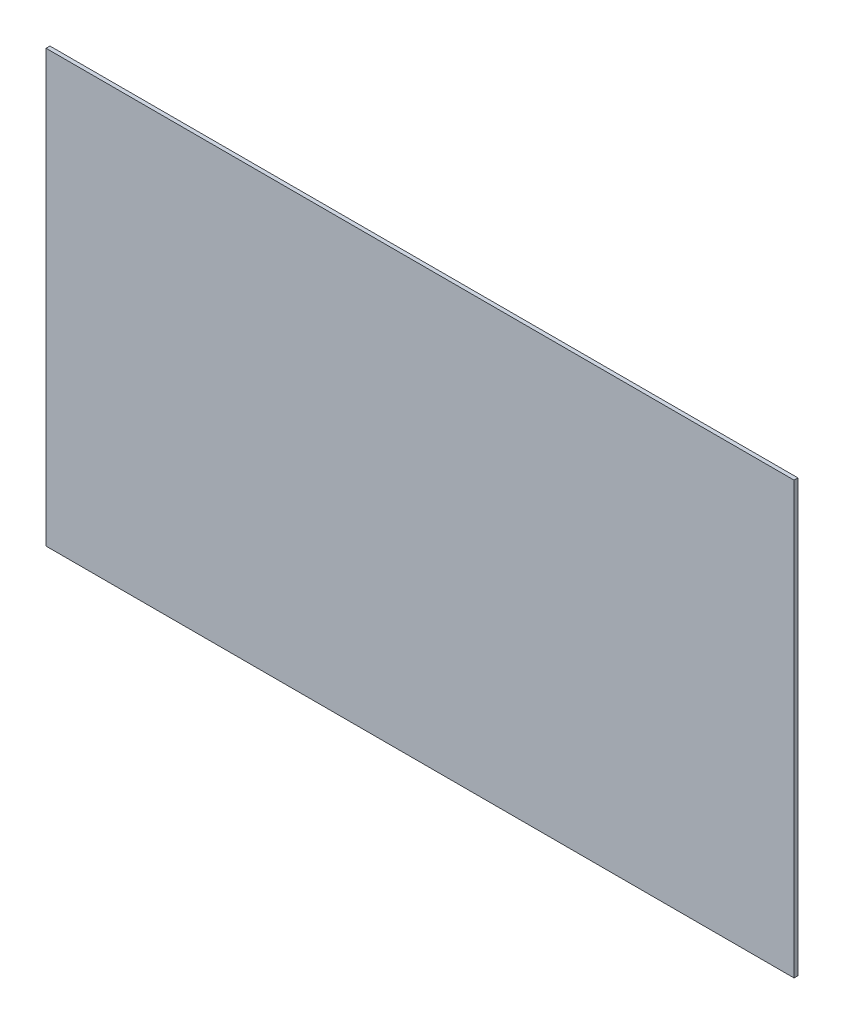
ISO-10303-21;
HEADER;
FILE_DESCRIPTION(('STEP AP214'),'2;1');
FILE_NAME('part.step','',(''),(''),'','','');
FILE_SCHEMA(('AUTOMOTIVE_DESIGN { 1 0 10303 214 1 1 1 1 }'));
ENDSEC;
DATA;
#1=APPLICATION_CONTEXT('core data for automotive mechanical design processes');
#2=APPLICATION_PROTOCOL_DEFINITION('international standard','automotive_design',2000,#1);
#3=PRODUCT_CONTEXT('',#1,'mechanical');
#4=PRODUCT('Part','Part','',(#3));
#5=PRODUCT_RELATED_PRODUCT_CATEGORY('part','',(#4));
#6=PRODUCT_DEFINITION_FORMATION('','',#4);
#7=PRODUCT_DEFINITION_CONTEXT('part definition',#1,'design');
#8=PRODUCT_DEFINITION('design','',#6,#7);
#9=PRODUCT_DEFINITION_SHAPE('','',#8);
#10=(LENGTH_UNIT() NAMED_UNIT(*) SI_UNIT(.MILLI.,.METRE.));
#11=(NAMED_UNIT(*) PLANE_ANGLE_UNIT() SI_UNIT($,.RADIAN.));
#12=(NAMED_UNIT(*) SI_UNIT($,.STERADIAN.) SOLID_ANGLE_UNIT());
#13=UNCERTAINTY_MEASURE_WITH_UNIT(LENGTH_MEASURE(1.E-05),#10,'distance_accuracy_value','');
#14=(GEOMETRIC_REPRESENTATION_CONTEXT(3) GLOBAL_UNCERTAINTY_ASSIGNED_CONTEXT((#13)) GLOBAL_UNIT_ASSIGNED_CONTEXT((#10,
#11,#12)) REPRESENTATION_CONTEXT('',''));
#15=CARTESIAN_POINT('',(0.,0.,0.));
#16=DIRECTION('',(0.,0.,1.));
#17=DIRECTION('',(1.,0.,0.));
#18=AXIS2_PLACEMENT_3D('',#15,#16,#17);
#19=CARTESIAN_POINT('',(0.,0.,9.525));
#20=DIRECTION('',(0.,0.,1.));
#21=DIRECTION('',(1.,0.,0.));
#22=AXIS2_PLACEMENT_3D('',#19,#20,#21);
#23=PLANE('',#22);
#24=DIRECTION('',(0.,1.,0.));
#25=VECTOR('',#24,1.);
#26=CARTESIAN_POINT('',(0.,1054.1,9.525));
#27=LINE('',#26,#25);
#28=CARTESIAN_POINT('',(0.,0.,9.525));
#29=VERTEX_POINT('',#28);
#30=CARTESIAN_POINT('',(0.,1054.1,9.525));
#31=VERTEX_POINT('',#30);
#32=EDGE_CURVE('E67',#29,#31,#27,.T.);
#33=ORIENTED_EDGE('',*,*,#32,.F.);
#34=DIRECTION('',(1.,0.,0.));
#35=VECTOR('',#34,1.);
#36=CARTESIAN_POINT('',(0.,0.,9.525));
#37=LINE('',#36,#35);
#38=CARTESIAN_POINT('',(1828.8,0.,9.525));
#39=VERTEX_POINT('',#38);
#40=EDGE_CURVE('E19',#39,#29,#37,.F.);
#41=ORIENTED_EDGE('',*,*,#40,.F.);
#42=DIRECTION('',(0.,1.,0.));
#43=VECTOR('',#42,1.);
#44=CARTESIAN_POINT('',(1828.8,0.,9.525));
#45=LINE('',#44,#43);
#46=CARTESIAN_POINT('',(1828.8,1054.1,9.525));
#47=VERTEX_POINT('',#46);
#48=EDGE_CURVE('E57',#47,#39,#45,.F.);
#49=ORIENTED_EDGE('',*,*,#48,.F.);
#50=DIRECTION('',(1.,0.,0.));
#51=VECTOR('',#50,1.);
#52=CARTESIAN_POINT('',(1828.8,1054.1,9.525));
#53=LINE('',#52,#51);
#54=EDGE_CURVE('E52',#31,#47,#53,.T.);
#55=ORIENTED_EDGE('',*,*,#54,.F.);
#56=EDGE_LOOP('',(#33,#41,#49,#55));
#57=FACE_BOUND('',#56,.T.);
#58=ADVANCED_FACE('F16',(#57),#23,.T.);
#59=CARTESIAN_POINT('',(0.,0.,0.));
#60=DIRECTION('',(0.,-1.,0.));
#61=DIRECTION('',(0.,0.,-1.));
#62=AXIS2_PLACEMENT_3D('',#59,#60,#61);
#63=PLANE('',#62);
#64=DIRECTION('',(0.,0.,1.));
#65=VECTOR('',#64,1.);
#66=CARTESIAN_POINT('',(0.,0.,0.));
#67=LINE('',#66,#65);
#68=CARTESIAN_POINT('',(0.,0.,0.));
#69=VERTEX_POINT('',#68);
#70=EDGE_CURVE('E78',#69,#29,#67,.T.);
#71=ORIENTED_EDGE('',*,*,#70,.F.);
#72=DIRECTION('',(1.,0.,0.));
#73=VECTOR('',#72,1.);
#74=CARTESIAN_POINT('',(0.,0.,0.));
#75=LINE('',#74,#73);
#76=CARTESIAN_POINT('',(1828.8,0.,0.));
#77=VERTEX_POINT('',#76);
#78=EDGE_CURVE('E73',#69,#77,#75,.T.);
#79=ORIENTED_EDGE('',*,*,#78,.T.);
#80=DIRECTION('',(0.,0.,-1.));
#81=VECTOR('',#80,1.);
#82=CARTESIAN_POINT('',(1828.8,0.,0.));
#83=LINE('',#82,#81);
#84=EDGE_CURVE('E62',#39,#77,#83,.T.);
#85=ORIENTED_EDGE('',*,*,#84,.F.);
#86=ORIENTED_EDGE('',*,*,#40,.T.);
#87=EDGE_LOOP('',(#71,#79,#85,#86));
#88=FACE_BOUND('',#87,.T.);
#89=ADVANCED_FACE('F72',(#88),#63,.T.);
#90=CARTESIAN_POINT('',(1828.8,0.,0.));
#91=DIRECTION('',(1.,0.,0.));
#92=DIRECTION('',(0.,0.,-1.));
#93=AXIS2_PLACEMENT_3D('',#90,#91,#92);
#94=PLANE('',#93);
#95=ORIENTED_EDGE('',*,*,#84,.T.);
#96=DIRECTION('',(0.,1.,0.));
#97=VECTOR('',#96,1.);
#98=CARTESIAN_POINT('',(1828.8,0.,0.));
#99=LINE('',#98,#97);
#100=CARTESIAN_POINT('',(1828.8,1054.1,0.));
#101=VERTEX_POINT('',#100);
#102=EDGE_CURVE('E83',#77,#101,#99,.T.);
#103=ORIENTED_EDGE('',*,*,#102,.T.);
#104=DIRECTION('',(0.,0.,1.));
#105=VECTOR('',#104,1.);
#106=CARTESIAN_POINT('',(1828.8,1054.1,0.));
#107=LINE('',#106,#105);
#108=EDGE_CURVE('E64',#47,#101,#107,.F.);
#109=ORIENTED_EDGE('',*,*,#108,.F.);
#110=ORIENTED_EDGE('',*,*,#48,.T.);
#111=EDGE_LOOP('',(#95,#103,#109,#110));
#112=FACE_BOUND('',#111,.T.);
#113=ADVANCED_FACE('F59',(#112),#94,.T.);
#114=CARTESIAN_POINT('',(1828.8,1054.1,0.));
#115=DIRECTION('',(0.,1.,0.));
#116=DIRECTION('',(0.,0.,1.));
#117=AXIS2_PLACEMENT_3D('',#114,#115,#116);
#118=PLANE('',#117);
#119=ORIENTED_EDGE('',*,*,#108,.T.);
#120=DIRECTION('',(1.,0.,0.));
#121=VECTOR('',#120,1.);
#122=CARTESIAN_POINT('',(0.,1054.1,0.));
#123=LINE('',#122,#121);
#124=CARTESIAN_POINT('',(0.,1054.1,0.));
#125=VERTEX_POINT('',#124);
#126=EDGE_CURVE('E25',#101,#125,#123,.F.);
#127=ORIENTED_EDGE('',*,*,#126,.T.);
#128=DIRECTION('',(0.,0.,1.));
#129=VECTOR('',#128,1.);
#130=CARTESIAN_POINT('',(0.,1054.1,0.));
#131=LINE('',#130,#129);
#132=EDGE_CURVE('E33',#31,#125,#131,.F.);
#133=ORIENTED_EDGE('',*,*,#132,.F.);
#134=ORIENTED_EDGE('',*,*,#54,.T.);
#135=EDGE_LOOP('',(#119,#127,#133,#134));
#136=FACE_BOUND('',#135,.T.);
#137=ADVANCED_FACE('F87',(#136),#118,.T.);
#138=CARTESIAN_POINT('',(0.,1054.1,0.));
#139=DIRECTION('',(-1.,0.,0.));
#140=DIRECTION('',(0.,0.,1.));
#141=AXIS2_PLACEMENT_3D('',#138,#139,#140);
#142=PLANE('',#141);
#143=ORIENTED_EDGE('',*,*,#132,.T.);
#144=DIRECTION('',(0.,1.,0.));
#145=VECTOR('',#144,1.);
#146=CARTESIAN_POINT('',(0.,0.,0.));
#147=LINE('',#146,#145);
#148=EDGE_CURVE('E11',#125,#69,#147,.F.);
#149=ORIENTED_EDGE('',*,*,#148,.T.);
#150=ORIENTED_EDGE('',*,*,#70,.T.);
#151=ORIENTED_EDGE('',*,*,#32,.T.);
#152=EDGE_LOOP('',(#143,#149,#150,#151));
#153=FACE_BOUND('',#152,.T.);
#154=ADVANCED_FACE('F90',(#153),#142,.T.);
#155=CARTESIAN_POINT('',(0.,0.,0.));
#156=DIRECTION('',(0.,0.,1.));
#157=DIRECTION('',(1.,0.,0.));
#158=AXIS2_PLACEMENT_3D('',#155,#156,#157);
#159=PLANE('',#158);
#160=ORIENTED_EDGE('',*,*,#126,.F.);
#161=ORIENTED_EDGE('',*,*,#102,.F.);
#162=ORIENTED_EDGE('',*,*,#78,.F.);
#163=ORIENTED_EDGE('',*,*,#148,.F.);
#164=EDGE_LOOP('',(#160,#161,#162,#163));
#165=FACE_BOUND('',#164,.T.);
#166=ADVANCED_FACE('F89',(#165),#159,.F.);
#167=CLOSED_SHELL('',(#58,#89,#113,#137,#154,#166));
#168=MANIFOLD_SOLID_BREP('B1',#167);
#169=ADVANCED_BREP_SHAPE_REPRESENTATION('',(#18,#168),#14);
#170=SHAPE_DEFINITION_REPRESENTATION(#9,#169);
ENDSEC;
END-ISO-10303-21;
